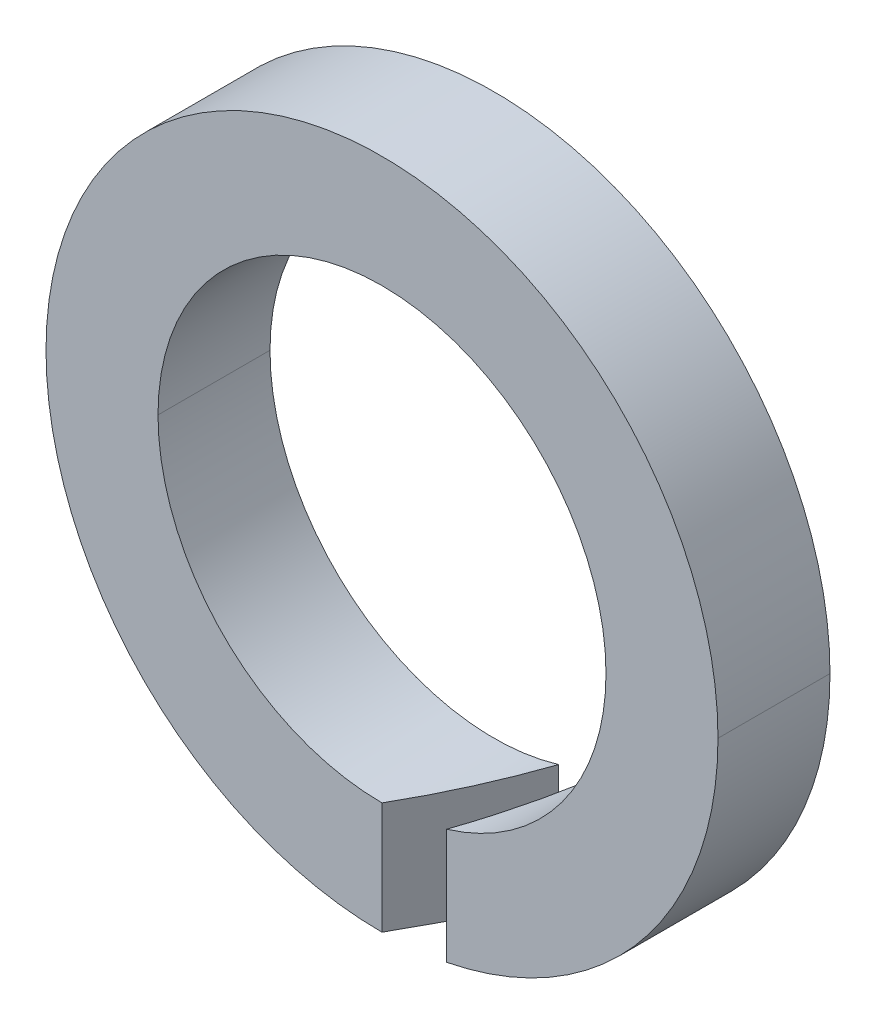
ISO-10303-21;
HEADER;
FILE_DESCRIPTION(('STEP AP214'),'2;1');
FILE_NAME('part.step','',(''),(''),'','','');
FILE_SCHEMA(('AUTOMOTIVE_DESIGN { 1 0 10303 214 1 1 1 1 }'));
ENDSEC;
DATA;
#1=APPLICATION_CONTEXT('core data for automotive mechanical design processes');
#2=APPLICATION_PROTOCOL_DEFINITION('international standard','automotive_design',2000,#1);
#3=PRODUCT_CONTEXT('',#1,'mechanical');
#4=PRODUCT('Part','Part','',(#3));
#5=PRODUCT_RELATED_PRODUCT_CATEGORY('part','',(#4));
#6=PRODUCT_DEFINITION_FORMATION('','',#4);
#7=PRODUCT_DEFINITION_CONTEXT('part definition',#1,'design');
#8=PRODUCT_DEFINITION('design','',#6,#7);
#9=PRODUCT_DEFINITION_SHAPE('','',#8);
#10=(LENGTH_UNIT() NAMED_UNIT(*) SI_UNIT(.MILLI.,.METRE.));
#11=(NAMED_UNIT(*) PLANE_ANGLE_UNIT() SI_UNIT($,.RADIAN.));
#12=(NAMED_UNIT(*) SI_UNIT($,.STERADIAN.) SOLID_ANGLE_UNIT());
#13=UNCERTAINTY_MEASURE_WITH_UNIT(LENGTH_MEASURE(1.E-05),#10,'distance_accuracy_value','');
#14=(GEOMETRIC_REPRESENTATION_CONTEXT(3) GLOBAL_UNCERTAINTY_ASSIGNED_CONTEXT((#13)) GLOBAL_UNIT_ASSIGNED_CONTEXT((#10,
#11,#12)) REPRESENTATION_CONTEXT('',''));
#15=CARTESIAN_POINT('',(0.,0.,0.));
#16=DIRECTION('',(0.,0.,1.));
#17=DIRECTION('',(1.,0.,0.));
#18=AXIS2_PLACEMENT_3D('',#15,#16,#17);
#19=CARTESIAN_POINT('',(0.,0.,-1.1));
#20=DIRECTION('',(0.,0.,1.));
#21=DIRECTION('',(1.,0.,0.));
#22=AXIS2_PLACEMENT_3D('',#19,#20,#21);
#23=CYLINDRICAL_SURFACE('',#22,3.3);
#24=DIRECTION('',(0.,0.,1.));
#25=VECTOR('',#24,1.);
#26=CARTESIAN_POINT('',(-3.3,0.,-1.1));
#27=LINE('',#26,#25);
#28=CARTESIAN_POINT('',(-3.3,0.,-1.1));
#29=VERTEX_POINT('',#28);
#30=CARTESIAN_POINT('',(-3.3,0.,0.));
#31=VERTEX_POINT('',#30);
#32=EDGE_CURVE('E44',#29,#31,#27,.T.);
#33=ORIENTED_EDGE('',*,*,#32,.F.);
#34=CARTESIAN_POINT('',(0.,0.,-1.1));
#35=DIRECTION('',(0.,0.,1.));
#36=DIRECTION('',(1.,0.,0.));
#37=AXIS2_PLACEMENT_3D('',#34,#35,#36);
#38=CIRCLE('',#37,3.3);
#39=CARTESIAN_POINT('',(0.635085296108595,-3.23831231765354,-1.1));
#40=VERTEX_POINT('',#39);
#41=EDGE_CURVE('E11',#29,#40,#38,.T.);
#42=ORIENTED_EDGE('',*,*,#41,.T.);
#43=CARTESIAN_POINT('',(0.,-3.3,0.));
#44=CARTESIAN_POINT('',(0.213357689750903,-3.3,-0.369546358834078));
#45=CARTESIAN_POINT('',(0.425715952233915,-3.27937302419066,-0.737361658861697));
#46=CARTESIAN_POINT('',(0.635085296108595,-3.23831231765354,-1.1));
#47=(BOUNDED_CURVE() B_SPLINE_CURVE(3,(#43,#44,#45,#46),.UNSPECIFIED.,.F.,
.F.) B_SPLINE_CURVE_WITH_KNOTS((4,4),(1.5707963267949,1.76445462723923),
.UNSPECIFIED.) CURVE() GEOMETRIC_REPRESENTATION_ITEM() RATIONAL_B_SPLINE_CURVE((1.,
0.996877146326252,0.996877146326252,1.)) REPRESENTATION_ITEM(''));
#48=CARTESIAN_POINT('',(0.,-3.3,0.));
#49=VERTEX_POINT('',#48);
#50=EDGE_CURVE('E176',#49,#40,#47,.T.);
#51=ORIENTED_EDGE('',*,*,#50,.F.);
#52=CARTESIAN_POINT('',(0.,0.,0.));
#53=DIRECTION('',(0.,0.,1.));
#54=DIRECTION('',(1.,0.,0.));
#55=AXIS2_PLACEMENT_3D('',#52,#53,#54);
#56=CIRCLE('',#55,3.3);
#57=EDGE_CURVE('E151',#31,#49,#56,.T.);
#58=ORIENTED_EDGE('',*,*,#57,.F.);
#59=EDGE_LOOP('',(#33,#42,#51,#58));
#60=FACE_BOUND('',#59,.T.);
#61=ADVANCED_FACE('F17',(#60),#23,.T.);
#62=CARTESIAN_POINT('',(0.,0.,-1.1));
#63=DIRECTION('',(0.,0.,1.));
#64=DIRECTION('',(1.,0.,0.));
#65=AXIS2_PLACEMENT_3D('',#62,#63,#64);
#66=CYLINDRICAL_SURFACE('',#65,3.3);
#67=CARTESIAN_POINT('',(0.,0.,-1.1));
#68=DIRECTION('',(0.,0.,1.));
#69=DIRECTION('',(1.,0.,0.));
#70=AXIS2_PLACEMENT_3D('',#67,#68,#69);
#71=CIRCLE('',#70,3.3);
#72=CARTESIAN_POINT('',(3.3,0.,-1.1));
#73=VERTEX_POINT('',#72);
#74=EDGE_CURVE('E30',#73,#29,#71,.T.);
#75=ORIENTED_EDGE('',*,*,#74,.T.);
#76=ORIENTED_EDGE('',*,*,#32,.T.);
#77=CARTESIAN_POINT('',(0.,0.,0.));
#78=DIRECTION('',(0.,0.,1.));
#79=DIRECTION('',(1.,0.,0.));
#80=AXIS2_PLACEMENT_3D('',#77,#78,#79);
#81=CIRCLE('',#80,3.3);
#82=CARTESIAN_POINT('',(3.3,0.,0.));
#83=VERTEX_POINT('',#82);
#84=EDGE_CURVE('E147',#83,#31,#81,.T.);
#85=ORIENTED_EDGE('',*,*,#84,.F.);
#86=DIRECTION('',(0.,0.,1.));
#87=VECTOR('',#86,1.);
#88=CARTESIAN_POINT('',(3.3,0.,-1.1));
#89=LINE('',#88,#87);
#90=EDGE_CURVE('E179',#73,#83,#89,.T.);
#91=ORIENTED_EDGE('',*,*,#90,.F.);
#92=EDGE_LOOP('',(#75,#76,#85,#91));
#93=FACE_BOUND('',#92,.T.);
#94=ADVANCED_FACE('F325',(#93),#66,.T.);
#95=CARTESIAN_POINT('',(0.,0.,-1.1));
#96=DIRECTION('',(0.,0.,1.));
#97=DIRECTION('',(1.,0.,0.));
#98=AXIS2_PLACEMENT_3D('',#95,#96,#97);
#99=PLANE('',#98);
#100=CARTESIAN_POINT('',(0.,0.,-1.1));
#101=DIRECTION('',(0.,0.,1.));
#102=DIRECTION('',(1.,0.,0.));
#103=AXIS2_PLACEMENT_3D('',#100,#101,#102);
#104=CIRCLE('',#103,3.3);
#105=CARTESIAN_POINT('',(1.27017059221718,-3.04576208306996,-1.1));
#106=VERTEX_POINT('',#105);
#107=EDGE_CURVE('E170',#106,#73,#104,.T.);
#108=ORIENTED_EDGE('',*,*,#107,.F.);
#109=DIRECTION('',(0.,1.,0.));
#110=VECTOR('',#109,1.);
#111=CARTESIAN_POINT('',(1.27017059221718,-3.3,-1.1));
#112=LINE('',#111,#110);
#113=CARTESIAN_POINT('',(1.27017059221718,-1.79629247804099,-1.1));
#114=VERTEX_POINT('',#113);
#115=EDGE_CURVE('E119',#106,#114,#112,.T.);
#116=ORIENTED_EDGE('',*,*,#115,.T.);
#117=CARTESIAN_POINT('',(0.,0.,-1.1));
#118=DIRECTION('',(0.,0.,1.));
#119=DIRECTION('',(1.,0.,0.));
#120=AXIS2_PLACEMENT_3D('',#117,#118,#119);
#121=CIRCLE('',#120,2.2);
#122=CARTESIAN_POINT('',(2.2,0.,-1.1));
#123=VERTEX_POINT('',#122);
#124=EDGE_CURVE('E113',#114,#123,#121,.T.);
#125=ORIENTED_EDGE('',*,*,#124,.T.);
#126=CARTESIAN_POINT('',(0.,0.,-1.1));
#127=DIRECTION('',(0.,0.,1.));
#128=DIRECTION('',(1.,0.,0.));
#129=AXIS2_PLACEMENT_3D('',#126,#127,#128);
#130=CIRCLE('',#129,2.2);
#131=CARTESIAN_POINT('',(-2.2,0.,-1.1));
#132=VERTEX_POINT('',#131);
#133=EDGE_CURVE('E103',#123,#132,#130,.T.);
#134=ORIENTED_EDGE('',*,*,#133,.T.);
#135=CARTESIAN_POINT('',(0.,0.,-1.1));
#136=DIRECTION('',(0.,0.,1.));
#137=DIRECTION('',(1.,0.,0.));
#138=AXIS2_PLACEMENT_3D('',#135,#136,#137);
#139=CIRCLE('',#138,2.2);
#140=CARTESIAN_POINT('',(0.635085296108595,-2.10633963706394,-1.1));
#141=VERTEX_POINT('',#140);
#142=EDGE_CURVE('E114',#132,#141,#139,.T.);
#143=ORIENTED_EDGE('',*,*,#142,.T.);
#144=DIRECTION('',(0.,1.,0.));
#145=VECTOR('',#144,1.);
#146=CARTESIAN_POINT('',(0.635085296108595,-3.3,-1.1));
#147=LINE('',#146,#145);
#148=EDGE_CURVE('E159',#40,#141,#147,.T.);
#149=ORIENTED_EDGE('',*,*,#148,.F.);
#150=ORIENTED_EDGE('',*,*,#41,.F.);
#151=ORIENTED_EDGE('',*,*,#74,.F.);
#152=EDGE_LOOP('',(#108,#116,#125,#134,#143,#149,#150,#151));
#153=FACE_BOUND('',#152,.T.);
#154=ADVANCED_FACE('F117',(#153),#99,.F.);
#155=CARTESIAN_POINT('',(0.,-3.3,0.));
#156=DIRECTION('',(-0.866025403784436,0.,-0.5));
#157=DIRECTION('',(-0.5,0.,0.866025403784436));
#158=AXIS2_PLACEMENT_3D('',#155,#156,#157);
#159=PLANE('',#158);
#160=ORIENTED_EDGE('',*,*,#50,.T.);
#161=ORIENTED_EDGE('',*,*,#148,.T.);
#162=CARTESIAN_POINT('',(0.,-2.2,0.));
#163=CARTESIAN_POINT('',(0.215522298079651,-2.2,-0.373295570437956));
#164=CARTESIAN_POINT('',(0.428738405601197,-2.16855556547027,-0.742596701657338));
#165=CARTESIAN_POINT('',(0.635085296108595,-2.10633963706394,-1.1));
#166=(BOUNDED_CURVE() B_SPLINE_CURVE(3,(#162,#163,#164,#165),.UNSPECIFIED.,.F.,
.F.) B_SPLINE_CURVE_WITH_KNOTS((4,4),(1.5707963267949,1.86363909852347),
.UNSPECIFIED.) CURVE() GEOMETRIC_REPRESENTATION_ITEM() RATIONAL_B_SPLINE_CURVE((1.,
0.992866351251034,0.992866351251034,1.)) REPRESENTATION_ITEM(''));
#167=CARTESIAN_POINT('',(0.,-2.2,0.));
#168=VERTEX_POINT('',#167);
#169=EDGE_CURVE('E21',#168,#141,#166,.T.);
#170=ORIENTED_EDGE('',*,*,#169,.F.);
#171=DIRECTION('',(0.,1.,0.));
#172=VECTOR('',#171,1.);
#173=CARTESIAN_POINT('',(0.,-3.3,0.));
#174=LINE('',#173,#172);
#175=EDGE_CURVE('E162',#49,#168,#174,.T.);
#176=ORIENTED_EDGE('',*,*,#175,.F.);
#177=EDGE_LOOP('',(#160,#161,#170,#176));
#178=FACE_BOUND('',#177,.T.);
#179=ADVANCED_FACE('F206',(#178),#159,.F.);
#180=CARTESIAN_POINT('',(0.,0.,0.));
#181=DIRECTION('',(0.,0.,1.));
#182=DIRECTION('',(1.,0.,0.));
#183=AXIS2_PLACEMENT_3D('',#180,#181,#182);
#184=PLANE('',#183);
#185=DIRECTION('',(0.,1.,0.));
#186=VECTOR('',#185,1.);
#187=CARTESIAN_POINT('',(0.63508529610859,-3.3,0.));
#188=LINE('',#187,#186);
#189=CARTESIAN_POINT('',(0.63508529610859,-3.23831231765354,0.));
#190=VERTEX_POINT('',#189);
#191=CARTESIAN_POINT('',(0.63508529610859,-2.10633963706394,0.));
#192=VERTEX_POINT('',#191);
#193=EDGE_CURVE('E182',#190,#192,#188,.T.);
#194=ORIENTED_EDGE('',*,*,#193,.F.);
#195=CARTESIAN_POINT('',(0.,0.,0.));
#196=DIRECTION('',(0.,0.,1.));
#197=DIRECTION('',(1.,0.,0.));
#198=AXIS2_PLACEMENT_3D('',#195,#196,#197);
#199=CIRCLE('',#198,3.3);
#200=EDGE_CURVE('E150',#190,#83,#199,.T.);
#201=ORIENTED_EDGE('',*,*,#200,.T.);
#202=ORIENTED_EDGE('',*,*,#84,.T.);
#203=ORIENTED_EDGE('',*,*,#57,.T.);
#204=ORIENTED_EDGE('',*,*,#175,.T.);
#205=CARTESIAN_POINT('',(0.,0.,0.));
#206=DIRECTION('',(0.,0.,1.));
#207=DIRECTION('',(1.,0.,0.));
#208=AXIS2_PLACEMENT_3D('',#205,#206,#207);
#209=CIRCLE('',#208,2.2);
#210=CARTESIAN_POINT('',(-2.2,0.,0.));
#211=VERTEX_POINT('',#210);
#212=EDGE_CURVE('E145',#211,#168,#209,.T.);
#213=ORIENTED_EDGE('',*,*,#212,.F.);
#214=CARTESIAN_POINT('',(0.,0.,0.));
#215=DIRECTION('',(0.,0.,1.));
#216=DIRECTION('',(1.,0.,0.));
#217=AXIS2_PLACEMENT_3D('',#214,#215,#216);
#218=CIRCLE('',#217,2.2);
#219=CARTESIAN_POINT('',(2.2,0.,0.));
#220=VERTEX_POINT('',#219);
#221=EDGE_CURVE('E130',#220,#211,#218,.T.);
#222=ORIENTED_EDGE('',*,*,#221,.F.);
#223=CARTESIAN_POINT('',(0.,0.,0.));
#224=DIRECTION('',(0.,0.,1.));
#225=DIRECTION('',(1.,0.,0.));
#226=AXIS2_PLACEMENT_3D('',#223,#224,#225);
#227=CIRCLE('',#226,2.2);
#228=EDGE_CURVE('E128',#192,#220,#227,.T.);
#229=ORIENTED_EDGE('',*,*,#228,.F.);
#230=EDGE_LOOP('',(#194,#201,#202,#203,#204,#213,#222,#229));
#231=FACE_BOUND('',#230,.T.);
#232=ADVANCED_FACE('F19',(#231),#184,.T.);
#233=CARTESIAN_POINT('',(0.,0.,-1.1));
#234=DIRECTION('',(0.,0.,1.));
#235=DIRECTION('',(1.,0.,0.));
#236=AXIS2_PLACEMENT_3D('',#233,#234,#235);
#237=CYLINDRICAL_SURFACE('',#236,3.3);
#238=ORIENTED_EDGE('',*,*,#107,.T.);
#239=ORIENTED_EDGE('',*,*,#90,.T.);
#240=ORIENTED_EDGE('',*,*,#200,.F.);
#241=CARTESIAN_POINT('',(1.27017059221718,-3.04576208306996,-1.1));
#242=CARTESIAN_POINT('',(1.06530988376807,-3.13119490424113,-0.745170844491587));
#243=CARTESIAN_POINT('',(0.852897107235127,-3.19559590706796,-0.377261123359752));
#244=CARTESIAN_POINT('',(0.63508529610859,-3.23831231765354,0.));
#245=(BOUNDED_CURVE() B_SPLINE_CURVE(3,(#241,#242,#243,#244),.UNSPECIFIED.,.F.,
.F.) B_SPLINE_CURVE_WITH_KNOTS((4,4),(4.31728931309829,4.51873067994036),
.UNSPECIFIED.) CURVE() GEOMETRIC_REPRESENTATION_ITEM() RATIONAL_B_SPLINE_CURVE((1.,
0.99662130573407,0.99662130573407,1.)) REPRESENTATION_ITEM(''));
#246=EDGE_CURVE('E140',#106,#190,#245,.T.);
#247=ORIENTED_EDGE('',*,*,#246,.F.);
#248=EDGE_LOOP('',(#238,#239,#240,#247));
#249=FACE_BOUND('',#248,.T.);
#250=ADVANCED_FACE('F231',(#249),#237,.T.);
#251=CARTESIAN_POINT('',(0.,0.,-1.1));
#252=DIRECTION('',(0.,0.,1.));
#253=DIRECTION('',(1.,0.,0.));
#254=AXIS2_PLACEMENT_3D('',#251,#252,#253);
#255=CYLINDRICAL_SURFACE('',#254,2.2);
#256=ORIENTED_EDGE('',*,*,#142,.F.);
#257=DIRECTION('',(0.,0.,1.));
#258=VECTOR('',#257,1.);
#259=CARTESIAN_POINT('',(-2.2,0.,-1.1));
#260=LINE('',#259,#258);
#261=EDGE_CURVE('E109',#132,#211,#260,.T.);
#262=ORIENTED_EDGE('',*,*,#261,.T.);
#263=ORIENTED_EDGE('',*,*,#212,.T.);
#264=ORIENTED_EDGE('',*,*,#169,.T.);
#265=EDGE_LOOP('',(#256,#262,#263,#264));
#266=FACE_BOUND('',#265,.T.);
#267=ADVANCED_FACE('F210',(#266),#255,.F.);
#268=CARTESIAN_POINT('',(0.,0.,-1.1));
#269=DIRECTION('',(0.,0.,1.));
#270=DIRECTION('',(1.,0.,0.));
#271=AXIS2_PLACEMENT_3D('',#268,#269,#270);
#272=CYLINDRICAL_SURFACE('',#271,2.2);
#273=DIRECTION('',(0.,0.,1.));
#274=VECTOR('',#273,1.);
#275=CARTESIAN_POINT('',(2.2,0.,-1.1));
#276=LINE('',#275,#274);
#277=EDGE_CURVE('E107',#123,#220,#276,.T.);
#278=ORIENTED_EDGE('',*,*,#277,.F.);
#279=ORIENTED_EDGE('',*,*,#124,.F.);
#280=CARTESIAN_POINT('',(1.27017059221718,-1.79629247804099,-1.1));
#281=CARTESIAN_POINT('',(1.07614451600432,-1.93348963225813,-0.763936978006093));
#282=CARTESIAN_POINT('',(0.862601037529971,-2.03774105995538,-0.394068823663531));
#283=CARTESIAN_POINT('',(0.63508529610859,-2.10633963706394,0.));
#284=(BOUNDED_CURVE() B_SPLINE_CURVE(3,(#280,#281,#282,#283),.UNSPECIFIED.,.F.,
.F.) B_SPLINE_CURVE_WITH_KNOTS((4,4),(4.0969092717143,4.41954620865612),
.UNSPECIFIED.) CURVE() GEOMETRIC_REPRESENTATION_ITEM() RATIONAL_B_SPLINE_CURVE((1.,
0.991344246217718,0.991344246217718,1.)) REPRESENTATION_ITEM(''));
#285=EDGE_CURVE('E137',#114,#192,#284,.T.);
#286=ORIENTED_EDGE('',*,*,#285,.T.);
#287=ORIENTED_EDGE('',*,*,#228,.T.);
#288=EDGE_LOOP('',(#278,#279,#286,#287));
#289=FACE_BOUND('',#288,.T.);
#290=ADVANCED_FACE('F126',(#289),#272,.F.);
#291=CARTESIAN_POINT('',(0.,0.,-1.1));
#292=DIRECTION('',(0.,0.,1.));
#293=DIRECTION('',(1.,0.,0.));
#294=AXIS2_PLACEMENT_3D('',#291,#292,#293);
#295=CYLINDRICAL_SURFACE('',#294,2.2);
#296=ORIENTED_EDGE('',*,*,#261,.F.);
#297=ORIENTED_EDGE('',*,*,#133,.F.);
#298=ORIENTED_EDGE('',*,*,#277,.T.);
#299=ORIENTED_EDGE('',*,*,#221,.T.);
#300=EDGE_LOOP('',(#296,#297,#298,#299));
#301=FACE_BOUND('',#300,.T.);
#302=ADVANCED_FACE('F105',(#301),#295,.F.);
#303=CARTESIAN_POINT('',(0.63508529610859,-3.3,0.));
#304=DIRECTION('',(0.866025403784436,0.,0.5));
#305=DIRECTION('',(0.,-1.,0.));
#306=AXIS2_PLACEMENT_3D('',#303,#304,#305);
#307=PLANE('',#306);
#308=ORIENTED_EDGE('',*,*,#246,.T.);
#309=ORIENTED_EDGE('',*,*,#193,.T.);
#310=ORIENTED_EDGE('',*,*,#285,.F.);
#311=ORIENTED_EDGE('',*,*,#115,.F.);
#312=EDGE_LOOP('',(#308,#309,#310,#311));
#313=FACE_BOUND('',#312,.T.);
#314=ADVANCED_FACE('F236',(#313),#307,.F.);
#315=CLOSED_SHELL('',(#61,#94,#154,#179,#232,#250,#267,#290,#302,#314));
#316=MANIFOLD_SOLID_BREP('B1',#315);
#317=ADVANCED_BREP_SHAPE_REPRESENTATION('',(#18,#316),#14);
#318=SHAPE_DEFINITION_REPRESENTATION(#9,#317);
ENDSEC;
END-ISO-10303-21;
